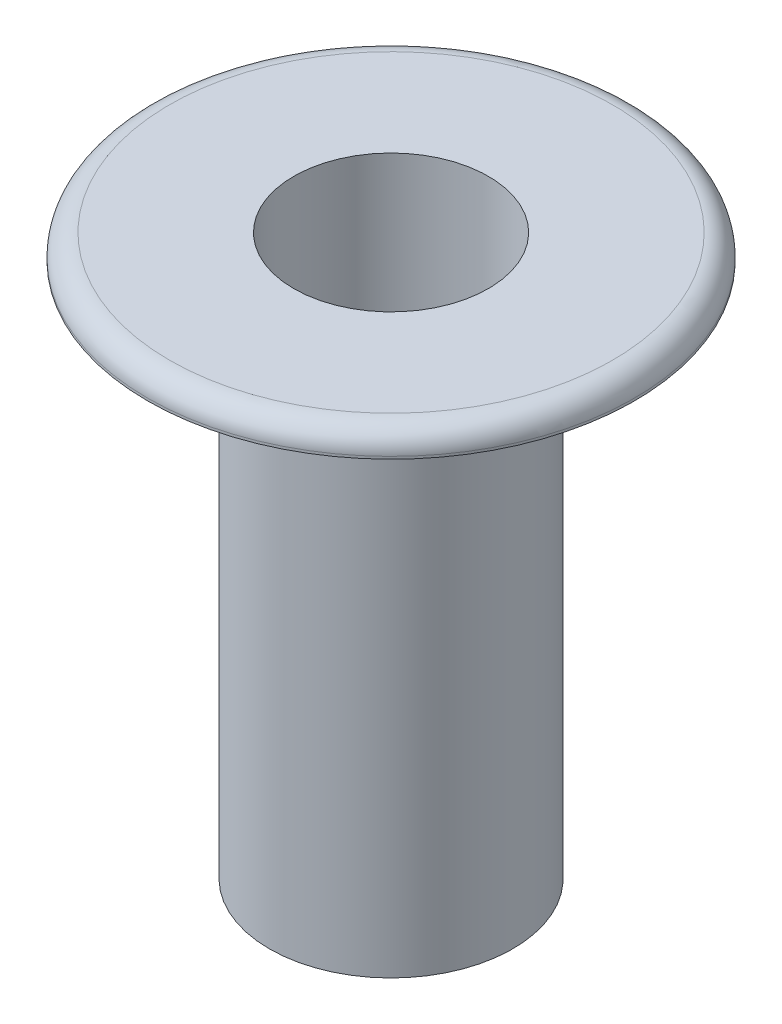
ISO-10303-21;
HEADER;
FILE_DESCRIPTION(('STEP AP214'),'2;1');
FILE_NAME('part.step','',(''),(''),'','','');
FILE_SCHEMA(('AUTOMOTIVE_DESIGN { 1 0 10303 214 1 1 1 1 }'));
ENDSEC;
DATA;
#1=APPLICATION_CONTEXT('core data for automotive mechanical design processes');
#2=APPLICATION_PROTOCOL_DEFINITION('international standard','automotive_design',2000,#1);
#3=PRODUCT_CONTEXT('',#1,'mechanical');
#4=PRODUCT('Part','Part','',(#3));
#5=PRODUCT_RELATED_PRODUCT_CATEGORY('part','',(#4));
#6=PRODUCT_DEFINITION_FORMATION('','',#4);
#7=PRODUCT_DEFINITION_CONTEXT('part definition',#1,'design');
#8=PRODUCT_DEFINITION('design','',#6,#7);
#9=PRODUCT_DEFINITION_SHAPE('','',#8);
#10=(LENGTH_UNIT() NAMED_UNIT(*) SI_UNIT(.MILLI.,.METRE.));
#11=(NAMED_UNIT(*) PLANE_ANGLE_UNIT() SI_UNIT($,.RADIAN.));
#12=(NAMED_UNIT(*) SI_UNIT($,.STERADIAN.) SOLID_ANGLE_UNIT());
#13=UNCERTAINTY_MEASURE_WITH_UNIT(LENGTH_MEASURE(1.E-05),#10,'distance_accuracy_value','');
#14=(GEOMETRIC_REPRESENTATION_CONTEXT(3) GLOBAL_UNCERTAINTY_ASSIGNED_CONTEXT((#13)) GLOBAL_UNIT_ASSIGNED_CONTEXT((#10,
#11,#12)) REPRESENTATION_CONTEXT('',''));
#15=CARTESIAN_POINT('',(0.,0.,0.));
#16=DIRECTION('',(0.,0.,1.));
#17=DIRECTION('',(1.,0.,0.));
#18=AXIS2_PLACEMENT_3D('',#15,#16,#17);
#19=CARTESIAN_POINT('',(0.,0.,0.));
#20=DIRECTION('',(0.,1.,0.));
#21=DIRECTION('',(0.,0.,1.));
#22=AXIS2_PLACEMENT_3D('',#19,#20,#21);
#23=PLANE('',#22);
#24=CARTESIAN_POINT('',(0.,0.,0.));
#25=DIRECTION('',(0.,1.,0.));
#26=DIRECTION('',(0.,0.,1.));
#27=AXIS2_PLACEMENT_3D('',#24,#25,#26);
#28=CIRCLE('',#27,1.25);
#29=CARTESIAN_POINT('',(0.,0.,1.25));
#30=VERTEX_POINT('',#29);
#31=EDGE_CURVE('E55',#30,#30,#28,.T.);
#32=ORIENTED_EDGE('',*,*,#31,.F.);
#33=EDGE_LOOP('',(#32));
#34=FACE_BOUND('',#33,.T.);
#35=CARTESIAN_POINT('',(0.,0.,0.));
#36=DIRECTION('',(0.,1.,0.));
#37=DIRECTION('',(0.,0.,1.));
#38=AXIS2_PLACEMENT_3D('',#35,#36,#37);
#39=CIRCLE('',#38,1.);
#40=CARTESIAN_POINT('',(0.,0.,1.));
#41=VERTEX_POINT('',#40);
#42=EDGE_CURVE('E60',#41,#41,#39,.T.);
#43=ORIENTED_EDGE('',*,*,#42,.T.);
#44=EDGE_LOOP('',(#43));
#45=FACE_BOUND('',#44,.T.);
#46=ADVANCED_FACE('F37',(#34,#45),#23,.F.);
#47=CARTESIAN_POINT('',(0.,5.5,0.));
#48=DIRECTION('',(0.,-1.,0.));
#49=DIRECTION('',(0.,0.,-1.));
#50=AXIS2_PLACEMENT_3D('',#47,#48,#49);
#51=CYLINDRICAL_SURFACE('',#50,1.25);
#52=CARTESIAN_POINT('',(0.,5.5,0.));
#53=DIRECTION('',(0.,1.,0.));
#54=DIRECTION('',(0.,0.,1.));
#55=AXIS2_PLACEMENT_3D('',#52,#53,#54);
#56=CIRCLE('',#55,1.25);
#57=CARTESIAN_POINT('',(0.,5.5,1.25));
#58=VERTEX_POINT('',#57);
#59=EDGE_CURVE('E50',#58,#58,#56,.T.);
#60=ORIENTED_EDGE('',*,*,#59,.F.);
#61=EDGE_LOOP('',(#60));
#62=FACE_BOUND('',#61,.T.);
#63=ORIENTED_EDGE('',*,*,#31,.T.);
#64=EDGE_LOOP('',(#63));
#65=FACE_BOUND('',#64,.T.);
#66=ADVANCED_FACE('F87',(#62,#65),#51,.T.);
#67=CARTESIAN_POINT('',(0.,5.5,0.));
#68=DIRECTION('',(0.,-1.,0.));
#69=DIRECTION('',(0.,0.,-1.));
#70=AXIS2_PLACEMENT_3D('',#67,#68,#69);
#71=CYLINDRICAL_SURFACE('',#70,1.);
#72=ORIENTED_EDGE('',*,*,#42,.F.);
#73=EDGE_LOOP('',(#72));
#74=FACE_BOUND('',#73,.T.);
#75=CARTESIAN_POINT('',(0.,5.75,0.));
#76=DIRECTION('',(0.,1.,0.));
#77=DIRECTION('',(0.,0.,1.));
#78=AXIS2_PLACEMENT_3D('',#75,#76,#77);
#79=CIRCLE('',#78,1.);
#80=CARTESIAN_POINT('',(0.,5.75,1.));
#81=VERTEX_POINT('',#80);
#82=EDGE_CURVE('E69',#81,#81,#79,.T.);
#83=ORIENTED_EDGE('',*,*,#82,.T.);
#84=EDGE_LOOP('',(#83));
#85=FACE_BOUND('',#84,.T.);
#86=ADVANCED_FACE('F74',(#74,#85),#71,.F.);
#87=CARTESIAN_POINT('',(0.,5.75,0.));
#88=DIRECTION('',(0.,1.,0.));
#89=DIRECTION('',(0.,0.,1.));
#90=AXIS2_PLACEMENT_3D('',#87,#88,#89);
#91=PLANE('',#90);
#92=CARTESIAN_POINT('',(0.,5.75,0.));
#93=DIRECTION('',(0.,1.,0.));
#94=DIRECTION('',(0.,0.,1.));
#95=AXIS2_PLACEMENT_3D('',#92,#93,#94);
#96=CIRCLE('',#95,2.275);
#97=CARTESIAN_POINT('',(0.,5.75,2.275));
#98=VERTEX_POINT('',#97);
#99=EDGE_CURVE('E45',#98,#98,#96,.T.);
#100=ORIENTED_EDGE('',*,*,#99,.T.);
#101=EDGE_LOOP('',(#100));
#102=FACE_BOUND('',#101,.T.);
#103=ORIENTED_EDGE('',*,*,#82,.F.);
#104=EDGE_LOOP('',(#103));
#105=FACE_BOUND('',#104,.T.);
#106=ADVANCED_FACE('F76',(#102,#105),#91,.T.);
#107=CARTESIAN_POINT('',(0.,5.5,0.));
#108=DIRECTION('',(0.,1.,0.));
#109=DIRECTION('',(0.,0.,1.));
#110=AXIS2_PLACEMENT_3D('',#107,#108,#109);
#111=PLANE('',#110);
#112=ORIENTED_EDGE('',*,*,#59,.T.);
#113=EDGE_LOOP('',(#112));
#114=FACE_BOUND('',#113,.T.);
#115=CARTESIAN_POINT('',(0.,5.5,0.));
#116=DIRECTION('',(0.,1.,0.));
#117=DIRECTION('',(0.,0.,1.));
#118=AXIS2_PLACEMENT_3D('',#115,#116,#117);
#119=CIRCLE('',#118,2.5);
#120=CARTESIAN_POINT('',(0.,5.5,2.5));
#121=VERTEX_POINT('',#120);
#122=EDGE_CURVE('E65',#121,#121,#119,.T.);
#123=ORIENTED_EDGE('',*,*,#122,.F.);
#124=EDGE_LOOP('',(#123));
#125=FACE_BOUND('',#124,.T.);
#126=ADVANCED_FACE('F78',(#114,#125),#111,.F.);
#127=CARTESIAN_POINT('',(0.,5.75,0.));
#128=DIRECTION('',(0.,-1.,0.));
#129=DIRECTION('',(0.,0.,-1.));
#130=AXIS2_PLACEMENT_3D('',#127,#128,#129);
#131=CYLINDRICAL_SURFACE('',#130,2.5);
#132=CARTESIAN_POINT('',(0.,5.525,0.));
#133=DIRECTION('',(0.,1.,0.));
#134=DIRECTION('',(0.,0.,1.));
#135=AXIS2_PLACEMENT_3D('',#132,#133,#134);
#136=CIRCLE('',#135,2.5);
#137=CARTESIAN_POINT('',(0.,5.525,2.5));
#138=VERTEX_POINT('',#137);
#139=EDGE_CURVE('E10',#138,#138,#136,.F.);
#140=ORIENTED_EDGE('',*,*,#139,.T.);
#141=EDGE_LOOP('',(#140));
#142=FACE_BOUND('',#141,.T.);
#143=ORIENTED_EDGE('',*,*,#122,.T.);
#144=EDGE_LOOP('',(#143));
#145=FACE_BOUND('',#144,.T.);
#146=ADVANCED_FACE('F84',(#142,#145),#131,.T.);
#147=CARTESIAN_POINT('',(0.,5.525,0.));
#148=DIRECTION('',(0.,1.,0.));
#149=DIRECTION('',(0.,0.,1.));
#150=AXIS2_PLACEMENT_3D('',#147,#148,#149);
#151=TOROIDAL_SURFACE('',#150,2.275,0.225);
#152=ORIENTED_EDGE('',*,*,#139,.F.);
#153=EDGE_LOOP('',(#152));
#154=FACE_BOUND('',#153,.T.);
#155=ORIENTED_EDGE('',*,*,#99,.F.);
#156=EDGE_LOOP('',(#155));
#157=FACE_BOUND('',#156,.T.);
#158=ADVANCED_FACE('F39',(#154,#157),#151,.T.);
#159=CLOSED_SHELL('',(#46,#66,#86,#106,#126,#146,#158));
#160=MANIFOLD_SOLID_BREP('B2',#159);
#161=ADVANCED_BREP_SHAPE_REPRESENTATION('',(#18,#160),#14);
#162=SHAPE_DEFINITION_REPRESENTATION(#9,#161);
ENDSEC;
END-ISO-10303-21;
